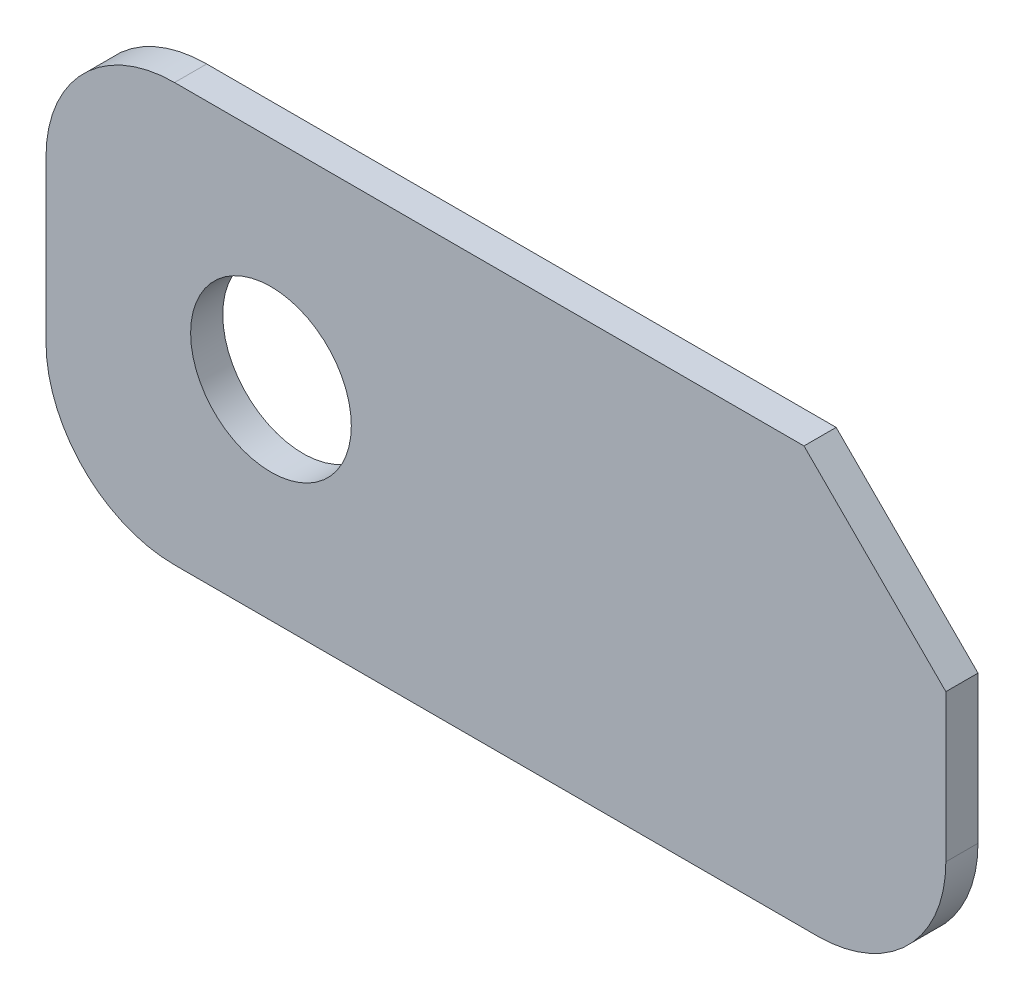
ISO-10303-21;
HEADER;
FILE_DESCRIPTION(('STEP AP214'),'2;1');
FILE_NAME('part.step','',(''),(''),'','','');
FILE_SCHEMA(('AUTOMOTIVE_DESIGN { 1 0 10303 214 1 1 1 1 }'));
ENDSEC;
DATA;
#1=APPLICATION_CONTEXT('core data for automotive mechanical design processes');
#2=APPLICATION_PROTOCOL_DEFINITION('international standard','automotive_design',2000,#1);
#3=PRODUCT_CONTEXT('',#1,'mechanical');
#4=PRODUCT('Part','Part','',(#3));
#5=PRODUCT_RELATED_PRODUCT_CATEGORY('part','',(#4));
#6=PRODUCT_DEFINITION_FORMATION('','',#4);
#7=PRODUCT_DEFINITION_CONTEXT('part definition',#1,'design');
#8=PRODUCT_DEFINITION('design','',#6,#7);
#9=PRODUCT_DEFINITION_SHAPE('','',#8);
#10=(LENGTH_UNIT() NAMED_UNIT(*) SI_UNIT(.MILLI.,.METRE.));
#11=(NAMED_UNIT(*) PLANE_ANGLE_UNIT() SI_UNIT($,.RADIAN.));
#12=(NAMED_UNIT(*) SI_UNIT($,.STERADIAN.) SOLID_ANGLE_UNIT());
#13=UNCERTAINTY_MEASURE_WITH_UNIT(LENGTH_MEASURE(1.E-05),#10,'distance_accuracy_value','');
#14=(GEOMETRIC_REPRESENTATION_CONTEXT(3) GLOBAL_UNCERTAINTY_ASSIGNED_CONTEXT((#13)) GLOBAL_UNIT_ASSIGNED_CONTEXT((#10,
#11,#12)) REPRESENTATION_CONTEXT('',''));
#15=CARTESIAN_POINT('',(0.,0.,0.));
#16=DIRECTION('',(0.,0.,1.));
#17=DIRECTION('',(1.,0.,0.));
#18=AXIS2_PLACEMENT_3D('',#15,#16,#17);
#19=CARTESIAN_POINT('',(-50.7689471033643,-10.9037377122802,2.));
#20=DIRECTION('',(0.,0.,-1.));
#21=DIRECTION('',(-1.,0.,0.));
#22=AXIS2_PLACEMENT_3D('',#19,#20,#21);
#23=CYLINDRICAL_SURFACE('',#22,8.);
#24=CARTESIAN_POINT('',(-50.7689471033643,-10.9037377122802,0.));
#25=DIRECTION('',(0.,0.,1.));
#26=DIRECTION('',(1.,0.,0.));
#27=AXIS2_PLACEMENT_3D('',#24,#25,#26);
#28=CIRCLE('',#27,8.);
#29=CARTESIAN_POINT('',(-50.7689471033643,-2.90373771228016,0.));
#30=VERTEX_POINT('',#29);
#31=CARTESIAN_POINT('',(-58.7689471033643,-10.9037377122802,0.));
#32=VERTEX_POINT('',#31);
#33=EDGE_CURVE('E128',#30,#32,#28,.T.);
#34=ORIENTED_EDGE('',*,*,#33,.T.);
#35=DIRECTION('',(0.,0.,-1.));
#36=VECTOR('',#35,1.);
#37=CARTESIAN_POINT('',(-58.7689471033643,-10.9037377122802,2.));
#38=LINE('',#37,#36);
#39=CARTESIAN_POINT('',(-58.7689471033643,-10.9037377122802,2.));
#40=VERTEX_POINT('',#39);
#41=EDGE_CURVE('E11',#40,#32,#38,.T.);
#42=ORIENTED_EDGE('',*,*,#41,.F.);
#43=CARTESIAN_POINT('',(-50.7689471033643,-10.9037377122802,2.));
#44=DIRECTION('',(0.,0.,1.));
#45=DIRECTION('',(1.,0.,0.));
#46=AXIS2_PLACEMENT_3D('',#43,#44,#45);
#47=CIRCLE('',#46,8.);
#48=CARTESIAN_POINT('',(-50.7689471033643,-2.90373771228016,2.));
#49=VERTEX_POINT('',#48);
#50=EDGE_CURVE('E86',#49,#40,#47,.T.);
#51=ORIENTED_EDGE('',*,*,#50,.F.);
#52=DIRECTION('',(0.,0.,-1.));
#53=VECTOR('',#52,1.);
#54=CARTESIAN_POINT('',(-50.7689471033643,-2.90373771228016,2.));
#55=LINE('',#54,#53);
#56=EDGE_CURVE('E49',#49,#30,#55,.T.);
#57=ORIENTED_EDGE('',*,*,#56,.T.);
#58=EDGE_LOOP('',(#34,#42,#51,#57));
#59=FACE_BOUND('',#58,.T.);
#60=ADVANCED_FACE('F33',(#59),#23,.T.);
#61=CARTESIAN_POINT('',(-58.7689471033643,-20.9037377122802,2.));
#62=DIRECTION('',(-1.,0.,0.));
#63=DIRECTION('',(0.,-1.,0.));
#64=AXIS2_PLACEMENT_3D('',#61,#62,#63);
#65=PLANE('',#64);
#66=DIRECTION('',(0.,1.,0.));
#67=VECTOR('',#66,1.);
#68=CARTESIAN_POINT('',(-58.7689471033643,-20.9037377122802,0.));
#69=LINE('',#68,#67);
#70=CARTESIAN_POINT('',(-58.7689471033643,-20.9037377122802,0.));
#71=VERTEX_POINT('',#70);
#72=EDGE_CURVE('E130',#71,#32,#69,.T.);
#73=ORIENTED_EDGE('',*,*,#72,.F.);
#74=DIRECTION('',(0.,0.,-1.));
#75=VECTOR('',#74,1.);
#76=CARTESIAN_POINT('',(-58.7689471033643,-20.9037377122802,2.));
#77=LINE('',#76,#75);
#78=CARTESIAN_POINT('',(-58.7689471033643,-20.9037377122802,2.));
#79=VERTEX_POINT('',#78);
#80=EDGE_CURVE('E41',#79,#71,#77,.T.);
#81=ORIENTED_EDGE('',*,*,#80,.F.);
#82=DIRECTION('',(0.,1.,0.));
#83=VECTOR('',#82,1.);
#84=CARTESIAN_POINT('',(-58.7689471033643,-20.9037377122802,2.));
#85=LINE('',#84,#83);
#86=EDGE_CURVE('E169',#79,#40,#85,.T.);
#87=ORIENTED_EDGE('',*,*,#86,.T.);
#88=ORIENTED_EDGE('',*,*,#41,.T.);
#89=EDGE_LOOP('',(#73,#81,#87,#88));
#90=FACE_BOUND('',#89,.T.);
#91=ADVANCED_FACE('F168',(#90),#65,.T.);
#92=CARTESIAN_POINT('',(-50.7689471033643,-20.9037377122802,2.));
#93=DIRECTION('',(0.,0.,-1.));
#94=DIRECTION('',(-1.,0.,0.));
#95=AXIS2_PLACEMENT_3D('',#92,#93,#94);
#96=CYLINDRICAL_SURFACE('',#95,7.99999999999995);
#97=CARTESIAN_POINT('',(-50.7689471033643,-20.9037377122802,0.));
#98=DIRECTION('',(0.,0.,1.));
#99=DIRECTION('',(1.,0.,0.));
#100=AXIS2_PLACEMENT_3D('',#97,#98,#99);
#101=CIRCLE('',#100,7.99999999999995);
#102=CARTESIAN_POINT('',(-50.7689471033643,-28.9037377122802,0.));
#103=VERTEX_POINT('',#102);
#104=EDGE_CURVE('E134',#71,#103,#101,.T.);
#105=ORIENTED_EDGE('',*,*,#104,.T.);
#106=DIRECTION('',(0.,0.,-1.));
#107=VECTOR('',#106,1.);
#108=CARTESIAN_POINT('',(-50.7689471033643,-28.9037377122802,2.));
#109=LINE('',#108,#107);
#110=CARTESIAN_POINT('',(-50.7689471033643,-28.9037377122802,2.));
#111=VERTEX_POINT('',#110);
#112=EDGE_CURVE('E154',#111,#103,#109,.T.);
#113=ORIENTED_EDGE('',*,*,#112,.F.);
#114=CARTESIAN_POINT('',(-50.7689471033643,-20.9037377122802,2.));
#115=DIRECTION('',(0.,0.,1.));
#116=DIRECTION('',(1.,0.,0.));
#117=AXIS2_PLACEMENT_3D('',#114,#115,#116);
#118=CIRCLE('',#117,7.99999999999995);
#119=EDGE_CURVE('E160',#79,#111,#118,.T.);
#120=ORIENTED_EDGE('',*,*,#119,.F.);
#121=ORIENTED_EDGE('',*,*,#80,.T.);
#122=EDGE_LOOP('',(#105,#113,#120,#121));
#123=FACE_BOUND('',#122,.T.);
#124=ADVANCED_FACE('F158',(#123),#96,.T.);
#125=CARTESIAN_POINT('',(-10.7689471033643,-28.9037377122802,2.));
#126=DIRECTION('',(0.,-1.,0.));
#127=DIRECTION('',(0.,0.,-1.));
#128=AXIS2_PLACEMENT_3D('',#125,#126,#127);
#129=PLANE('',#128);
#130=DIRECTION('',(-1.,0.,0.));
#131=VECTOR('',#130,1.);
#132=CARTESIAN_POINT('',(-10.7689471033643,-28.9037377122802,0.));
#133=LINE('',#132,#131);
#134=CARTESIAN_POINT('',(-10.7689471033643,-28.9037377122802,0.));
#135=VERTEX_POINT('',#134);
#136=EDGE_CURVE('E137',#135,#103,#133,.T.);
#137=ORIENTED_EDGE('',*,*,#136,.F.);
#138=DIRECTION('',(0.,0.,-1.));
#139=VECTOR('',#138,1.);
#140=CARTESIAN_POINT('',(-10.7689471033643,-28.9037377122802,2.));
#141=LINE('',#140,#139);
#142=CARTESIAN_POINT('',(-10.7689471033643,-28.9037377122802,2.));
#143=VERTEX_POINT('',#142);
#144=EDGE_CURVE('E152',#143,#135,#141,.T.);
#145=ORIENTED_EDGE('',*,*,#144,.F.);
#146=DIRECTION('',(-1.,0.,0.));
#147=VECTOR('',#146,1.);
#148=CARTESIAN_POINT('',(-10.7689471033643,-28.9037377122802,2.));
#149=LINE('',#148,#147);
#150=EDGE_CURVE('E251',#143,#111,#149,.T.);
#151=ORIENTED_EDGE('',*,*,#150,.T.);
#152=ORIENTED_EDGE('',*,*,#112,.T.);
#153=EDGE_LOOP('',(#137,#145,#151,#152));
#154=FACE_BOUND('',#153,.T.);
#155=ADVANCED_FACE('F189',(#154),#129,.T.);
#156=CARTESIAN_POINT('',(-10.7689471033643,-20.9037377122802,2.));
#157=DIRECTION('',(0.,0.,-1.));
#158=DIRECTION('',(-1.,0.,0.));
#159=AXIS2_PLACEMENT_3D('',#156,#157,#158);
#160=CYLINDRICAL_SURFACE('',#159,8.);
#161=CARTESIAN_POINT('',(-10.7689471033643,-20.9037377122802,0.));
#162=DIRECTION('',(0.,0.,1.));
#163=DIRECTION('',(1.,0.,0.));
#164=AXIS2_PLACEMENT_3D('',#161,#162,#163);
#165=CIRCLE('',#164,8.);
#166=CARTESIAN_POINT('',(-2.76894710336428,-20.9037377122801,0.));
#167=VERTEX_POINT('',#166);
#168=EDGE_CURVE('E140',#135,#167,#165,.T.);
#169=ORIENTED_EDGE('',*,*,#168,.T.);
#170=DIRECTION('',(0.,0.,-1.));
#171=VECTOR('',#170,1.);
#172=CARTESIAN_POINT('',(-2.76894710336428,-20.9037377122801,2.));
#173=LINE('',#172,#171);
#174=CARTESIAN_POINT('',(-2.76894710336428,-20.9037377122801,2.));
#175=VERTEX_POINT('',#174);
#176=EDGE_CURVE('E112',#175,#167,#173,.T.);
#177=ORIENTED_EDGE('',*,*,#176,.F.);
#178=CARTESIAN_POINT('',(-10.7689471033643,-20.9037377122802,2.));
#179=DIRECTION('',(0.,0.,1.));
#180=DIRECTION('',(1.,0.,0.));
#181=AXIS2_PLACEMENT_3D('',#178,#179,#180);
#182=CIRCLE('',#181,8.);
#183=EDGE_CURVE('E119',#143,#175,#182,.T.);
#184=ORIENTED_EDGE('',*,*,#183,.F.);
#185=ORIENTED_EDGE('',*,*,#144,.T.);
#186=EDGE_LOOP('',(#169,#177,#184,#185));
#187=FACE_BOUND('',#186,.T.);
#188=ADVANCED_FACE('F194',(#187),#160,.T.);
#189=CARTESIAN_POINT('',(-2.76894710336431,-11.7321648370263,2.));
#190=DIRECTION('',(1.,0.,0.));
#191=DIRECTION('',(0.,1.,0.));
#192=AXIS2_PLACEMENT_3D('',#189,#190,#191);
#193=PLANE('',#192);
#194=DIRECTION('',(0.,-1.,0.));
#195=VECTOR('',#194,1.);
#196=CARTESIAN_POINT('',(-2.76894710336431,-11.7321648370263,0.));
#197=LINE('',#196,#195);
#198=CARTESIAN_POINT('',(-2.76894710336431,-11.7321648370263,0.));
#199=VERTEX_POINT('',#198);
#200=EDGE_CURVE('E108',#199,#167,#197,.T.);
#201=ORIENTED_EDGE('',*,*,#200,.F.);
#202=DIRECTION('',(0.,0.,-1.));
#203=VECTOR('',#202,1.);
#204=CARTESIAN_POINT('',(-2.76894710336431,-11.7321648370263,2.));
#205=LINE('',#204,#203);
#206=CARTESIAN_POINT('',(-2.76894710336431,-11.7321648370263,2.));
#207=VERTEX_POINT('',#206);
#208=EDGE_CURVE('E103',#207,#199,#205,.T.);
#209=ORIENTED_EDGE('',*,*,#208,.F.);
#210=DIRECTION('',(0.,-1.,0.));
#211=VECTOR('',#210,1.);
#212=CARTESIAN_POINT('',(-2.76894710336431,-11.7321648370263,2.));
#213=LINE('',#212,#211);
#214=EDGE_CURVE('E106',#207,#175,#213,.T.);
#215=ORIENTED_EDGE('',*,*,#214,.T.);
#216=ORIENTED_EDGE('',*,*,#176,.T.);
#217=EDGE_LOOP('',(#201,#209,#215,#216));
#218=FACE_BOUND('',#217,.T.);
#219=ADVANCED_FACE('F105',(#218),#193,.T.);
#220=CARTESIAN_POINT('',(-11.5973742281106,-2.90373771228016,2.));
#221=DIRECTION('',(0.707106781186545,0.707106781186551,0.));
#222=DIRECTION('',(-0.70710678118655,0.707106781186545,0.));
#223=AXIS2_PLACEMENT_3D('',#220,#221,#222);
#224=PLANE('',#223);
#225=DIRECTION('',(0.707106781186551,-0.707106781186545,0.));
#226=VECTOR('',#225,1.);
#227=CARTESIAN_POINT('',(-11.5973742281106,-2.90373771228016,0.));
#228=LINE('',#227,#226);
#229=CARTESIAN_POINT('',(-11.5973742281106,-2.90373771228016,0.));
#230=VERTEX_POINT('',#229);
#231=EDGE_CURVE('E144',#230,#199,#228,.T.);
#232=ORIENTED_EDGE('',*,*,#231,.F.);
#233=DIRECTION('',(0.,0.,-1.));
#234=VECTOR('',#233,1.);
#235=CARTESIAN_POINT('',(-11.5973742281106,-2.90373771228016,2.));
#236=LINE('',#235,#234);
#237=CARTESIAN_POINT('',(-11.5973742281106,-2.90373771228016,2.));
#238=VERTEX_POINT('',#237);
#239=EDGE_CURVE('E74',#238,#230,#236,.T.);
#240=ORIENTED_EDGE('',*,*,#239,.F.);
#241=DIRECTION('',(0.707106781186551,-0.707106781186545,0.));
#242=VECTOR('',#241,1.);
#243=CARTESIAN_POINT('',(-11.5973742281106,-2.90373771228016,2.));
#244=LINE('',#243,#242);
#245=EDGE_CURVE('E116',#238,#207,#244,.T.);
#246=ORIENTED_EDGE('',*,*,#245,.T.);
#247=ORIENTED_EDGE('',*,*,#208,.T.);
#248=EDGE_LOOP('',(#232,#240,#246,#247));
#249=FACE_BOUND('',#248,.T.);
#250=ADVANCED_FACE('F122',(#249),#224,.T.);
#251=CARTESIAN_POINT('',(-50.7689471033643,-2.90373771228016,2.));
#252=DIRECTION('',(0.,1.,0.));
#253=DIRECTION('',(0.,0.,1.));
#254=AXIS2_PLACEMENT_3D('',#251,#252,#253);
#255=PLANE('',#254);
#256=DIRECTION('',(1.,0.,0.));
#257=VECTOR('',#256,1.);
#258=CARTESIAN_POINT('',(-50.7689471033643,-2.90373771228016,0.));
#259=LINE('',#258,#257);
#260=EDGE_CURVE('E146',#30,#230,#259,.T.);
#261=ORIENTED_EDGE('',*,*,#260,.F.);
#262=ORIENTED_EDGE('',*,*,#56,.F.);
#263=DIRECTION('',(1.,0.,0.));
#264=VECTOR('',#263,1.);
#265=CARTESIAN_POINT('',(-50.7689471033643,-2.90373771228016,2.));
#266=LINE('',#265,#264);
#267=EDGE_CURVE('E123',#49,#238,#266,.T.);
#268=ORIENTED_EDGE('',*,*,#267,.T.);
#269=ORIENTED_EDGE('',*,*,#239,.T.);
#270=EDGE_LOOP('',(#261,#262,#268,#269));
#271=FACE_BOUND('',#270,.T.);
#272=ADVANCED_FACE('F170',(#271),#255,.T.);
#273=CARTESIAN_POINT('',(-50.7689471033643,-10.9037377122802,2.));
#274=DIRECTION('',(0.,0.,1.));
#275=DIRECTION('',(1.,0.,0.));
#276=AXIS2_PLACEMENT_3D('',#273,#274,#275);
#277=PLANE('',#276);
#278=CARTESIAN_POINT('',(-44.7689471033643,-15.9037377122802,2.));
#279=DIRECTION('',(0.,0.,1.));
#280=DIRECTION('',(1.,0.,0.));
#281=AXIS2_PLACEMENT_3D('',#278,#279,#280);
#282=CIRCLE('',#281,5.);
#283=CARTESIAN_POINT('',(-39.7689471033643,-15.9037377122802,2.));
#284=VERTEX_POINT('',#283);
#285=EDGE_CURVE('E131',#284,#284,#282,.T.);
#286=ORIENTED_EDGE('',*,*,#285,.F.);
#287=EDGE_LOOP('',(#286));
#288=FACE_BOUND('',#287,.T.);
#289=ORIENTED_EDGE('',*,*,#50,.T.);
#290=ORIENTED_EDGE('',*,*,#86,.F.);
#291=ORIENTED_EDGE('',*,*,#119,.T.);
#292=ORIENTED_EDGE('',*,*,#150,.F.);
#293=ORIENTED_EDGE('',*,*,#183,.T.);
#294=ORIENTED_EDGE('',*,*,#214,.F.);
#295=ORIENTED_EDGE('',*,*,#245,.F.);
#296=ORIENTED_EDGE('',*,*,#267,.F.);
#297=EDGE_LOOP('',(#289,#290,#291,#292,#293,#294,#295,#296));
#298=FACE_BOUND('',#297,.T.);
#299=ADVANCED_FACE('F115',(#288,#298),#277,.T.);
#300=CARTESIAN_POINT('',(-50.7689471033643,-10.9037377122802,0.));
#301=DIRECTION('',(0.,0.,1.));
#302=DIRECTION('',(1.,0.,0.));
#303=AXIS2_PLACEMENT_3D('',#300,#301,#302);
#304=PLANE('',#303);
#305=CARTESIAN_POINT('',(-44.7689471033643,-15.9037377122802,0.));
#306=DIRECTION('',(0.,0.,-1.));
#307=DIRECTION('',(-1.,0.,0.));
#308=AXIS2_PLACEMENT_3D('',#305,#306,#307);
#309=CIRCLE('',#308,5.);
#310=CARTESIAN_POINT('',(-49.7689471033643,-15.9037377122802,0.));
#311=VERTEX_POINT('',#310);
#312=EDGE_CURVE('E244',#311,#311,#309,.T.);
#313=ORIENTED_EDGE('',*,*,#312,.F.);
#314=EDGE_LOOP('',(#313));
#315=FACE_BOUND('',#314,.T.);
#316=ORIENTED_EDGE('',*,*,#33,.F.);
#317=ORIENTED_EDGE('',*,*,#260,.T.);
#318=ORIENTED_EDGE('',*,*,#231,.T.);
#319=ORIENTED_EDGE('',*,*,#200,.T.);
#320=ORIENTED_EDGE('',*,*,#168,.F.);
#321=ORIENTED_EDGE('',*,*,#136,.T.);
#322=ORIENTED_EDGE('',*,*,#104,.F.);
#323=ORIENTED_EDGE('',*,*,#72,.T.);
#324=EDGE_LOOP('',(#316,#317,#318,#319,#320,#321,#322,#323));
#325=FACE_BOUND('',#324,.T.);
#326=ADVANCED_FACE('F165',(#315,#325),#304,.F.);
#327=CARTESIAN_POINT('',(-44.7689471033643,-15.9037377122802,4.1));
#328=DIRECTION('',(0.,0.,-1.));
#329=DIRECTION('',(-1.,0.,0.));
#330=AXIS2_PLACEMENT_3D('',#327,#328,#329);
#331=CYLINDRICAL_SURFACE('',#330,5.);
#332=ORIENTED_EDGE('',*,*,#285,.T.);
#333=EDGE_LOOP('',(#332));
#334=FACE_BOUND('',#333,.T.);
#335=ORIENTED_EDGE('',*,*,#312,.T.);
#336=EDGE_LOOP('',(#335));
#337=FACE_BOUND('',#336,.T.);
#338=ADVANCED_FACE('F223',(#334,#337),#331,.F.);
#339=CLOSED_SHELL('',(#60,#91,#124,#155,#188,#219,#250,#272,#299,#326,#338));
#340=MANIFOLD_SOLID_BREP('B2',#339);
#341=ADVANCED_BREP_SHAPE_REPRESENTATION('',(#18,#340),#14);
#342=SHAPE_DEFINITION_REPRESENTATION(#9,#341);
ENDSEC;
END-ISO-10303-21;
